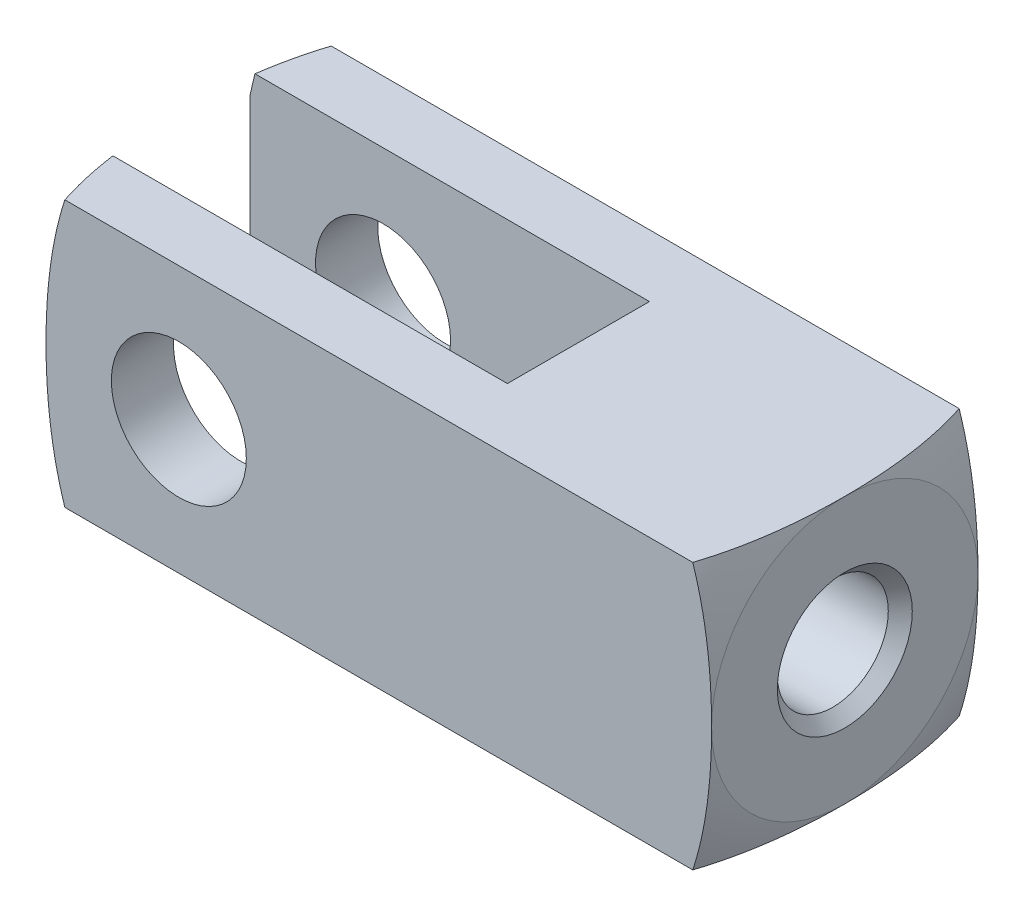
ISO-10303-21;
HEADER;
FILE_DESCRIPTION(('STEP AP214'),'2;1');
FILE_NAME('part.step','',(''),(''),'','','');
FILE_SCHEMA(('AUTOMOTIVE_DESIGN { 1 0 10303 214 1 1 1 1 }'));
ENDSEC;
DATA;
#1=APPLICATION_CONTEXT('core data for automotive mechanical design processes');
#2=APPLICATION_PROTOCOL_DEFINITION('international standard','automotive_design',2000,#1);
#3=PRODUCT_CONTEXT('',#1,'mechanical');
#4=PRODUCT('Part','Part','',(#3));
#5=PRODUCT_RELATED_PRODUCT_CATEGORY('part','',(#4));
#6=PRODUCT_DEFINITION_FORMATION('','',#4);
#7=PRODUCT_DEFINITION_CONTEXT('part definition',#1,'design');
#8=PRODUCT_DEFINITION('design','',#6,#7);
#9=PRODUCT_DEFINITION_SHAPE('','',#8);
#10=(LENGTH_UNIT() NAMED_UNIT(*) SI_UNIT(.MILLI.,.METRE.));
#11=(NAMED_UNIT(*) PLANE_ANGLE_UNIT() SI_UNIT($,.RADIAN.));
#12=(NAMED_UNIT(*) SI_UNIT($,.STERADIAN.) SOLID_ANGLE_UNIT());
#13=UNCERTAINTY_MEASURE_WITH_UNIT(LENGTH_MEASURE(1.E-05),#10,'distance_accuracy_value','');
#14=(GEOMETRIC_REPRESENTATION_CONTEXT(3) GLOBAL_UNCERTAINTY_ASSIGNED_CONTEXT((#13)) GLOBAL_UNIT_ASSIGNED_CONTEXT((#10,
#11,#12)) REPRESENTATION_CONTEXT('',''));
#15=CARTESIAN_POINT('',(0.,0.,0.));
#16=DIRECTION('',(0.,0.,1.));
#17=DIRECTION('',(1.,0.,0.));
#18=AXIS2_PLACEMENT_3D('',#15,#16,#17);
#19=CARTESIAN_POINT('',(19.0499999999361,0.,0.));
#20=DIRECTION('',(1.,0.,0.));
#21=DIRECTION('',(0.,0.,-1.));
#22=AXIS2_PLACEMENT_3D('',#19,#20,#21);
#23=CONICAL_SURFACE('',#22,2.41299999993316,0.785398163397448);
#24=CARTESIAN_POINT('',(18.62074,0.,0.));
#25=DIRECTION('',(-1.,0.,0.));
#26=DIRECTION('',(0.,0.,1.));
#27=AXIS2_PLACEMENT_3D('',#24,#25,#26);
#28=CIRCLE('',#27,1.98374);
#29=CARTESIAN_POINT('',(18.62074,0.,1.98374));
#30=VERTEX_POINT('',#29);
#31=EDGE_CURVE('E114',#30,#30,#28,.T.);
#32=ORIENTED_EDGE('',*,*,#31,.T.);
#33=EDGE_LOOP('',(#32));
#34=FACE_BOUND('',#33,.T.);
#35=CARTESIAN_POINT('',(19.0500000000497,0.,0.));
#36=DIRECTION('',(1.,0.,0.));
#37=DIRECTION('',(0.,0.,-1.));
#38=AXIS2_PLACEMENT_3D('',#35,#36,#37);
#39=CIRCLE('',#38,2.41300000004685);
#40=CARTESIAN_POINT('',(19.0500000000497,0.,-2.41300000004685));
#41=VERTEX_POINT('',#40);
#42=EDGE_CURVE('E640',#41,#41,#39,.T.);
#43=ORIENTED_EDGE('',*,*,#42,.T.);
#44=EDGE_LOOP('',(#43));
#45=FACE_BOUND('',#44,.T.);
#46=ADVANCED_FACE('F17',(#34,#45),#23,.F.);
#47=CARTESIAN_POINT('',(19.05,0.,0.));
#48=DIRECTION('',(-1.,0.,0.));
#49=DIRECTION('',(0.,0.,1.));
#50=AXIS2_PLACEMENT_3D('',#47,#48,#49);
#51=CYLINDRICAL_SURFACE('',#50,1.98374);
#52=CARTESIAN_POINT('',(9.525,0.,0.));
#53=DIRECTION('',(-1.,0.,0.));
#54=DIRECTION('',(0.,0.,1.));
#55=AXIS2_PLACEMENT_3D('',#52,#53,#54);
#56=CIRCLE('',#55,1.98374);
#57=CARTESIAN_POINT('',(9.525,0.,1.98374));
#58=VERTEX_POINT('',#57);
#59=EDGE_CURVE('E338',#58,#58,#56,.F.);
#60=ORIENTED_EDGE('',*,*,#59,.F.);
#61=EDGE_LOOP('',(#60));
#62=FACE_BOUND('',#61,.T.);
#63=ORIENTED_EDGE('',*,*,#31,.F.);
#64=EDGE_LOOP('',(#63));
#65=FACE_BOUND('',#64,.T.);
#66=ADVANCED_FACE('F432',(#62,#65),#51,.F.);
#67=CARTESIAN_POINT('',(0.,0.,-4.7625));
#68=DIRECTION('',(0.,0.,1.));
#69=DIRECTION('',(1.,0.,0.));
#70=AXIS2_PLACEMENT_3D('',#67,#68,#69);
#71=CYLINDRICAL_SURFACE('',#70,2.413);
#72=CARTESIAN_POINT('',(0.,0.,-2.54));
#73=DIRECTION('',(0.,0.,1.));
#74=DIRECTION('',(1.,0.,0.));
#75=AXIS2_PLACEMENT_3D('',#72,#73,#74);
#76=CIRCLE('',#75,2.413);
#77=CARTESIAN_POINT('',(2.413,0.,-2.54));
#78=VERTEX_POINT('',#77);
#79=EDGE_CURVE('E345',#78,#78,#76,.F.);
#80=ORIENTED_EDGE('',*,*,#79,.F.);
#81=EDGE_LOOP('',(#80));
#82=FACE_BOUND('',#81,.T.);
#83=CARTESIAN_POINT('',(0.,0.,-4.7625));
#84=DIRECTION('',(0.,0.,1.));
#85=DIRECTION('',(1.,0.,0.));
#86=AXIS2_PLACEMENT_3D('',#83,#84,#85);
#87=CIRCLE('',#86,2.413);
#88=CARTESIAN_POINT('',(2.413,0.,-4.7625));
#89=VERTEX_POINT('',#88);
#90=EDGE_CURVE('E642',#89,#89,#87,.F.);
#91=ORIENTED_EDGE('',*,*,#90,.T.);
#92=EDGE_LOOP('',(#91));
#93=FACE_BOUND('',#92,.T.);
#94=ADVANCED_FACE('F436',(#82,#93),#71,.F.);
#95=CARTESIAN_POINT('',(-4.7498,4.7625,4.7625));
#96=DIRECTION('',(1.,0.,0.));
#97=DIRECTION('',(0.,0.,-1.));
#98=AXIS2_PLACEMENT_3D('',#95,#96,#97);
#99=PLANE('',#98);
#100=CARTESIAN_POINT('',(-4.74979999999999,0.,0.));
#101=DIRECTION('',(1.,0.,0.));
#102=DIRECTION('',(0.,0.,-1.));
#103=AXIS2_PLACEMENT_3D('',#100,#101,#102);
#104=CIRCLE('',#103,4.7625);
#105=CARTESIAN_POINT('',(-4.74979999999999,-4.02862336909272,-2.54));
#106=VERTEX_POINT('',#105);
#107=CARTESIAN_POINT('',(-4.74979999999999,0.,-4.7625));
#108=VERTEX_POINT('',#107);
#109=EDGE_CURVE('E22',#106,#108,#104,.T.);
#110=ORIENTED_EDGE('',*,*,#109,.F.);
#111=DIRECTION('',(0.,1.,0.));
#112=VECTOR('',#111,1.);
#113=CARTESIAN_POINT('',(-4.7498,4.7625,-2.54));
#114=LINE('',#113,#112);
#115=CARTESIAN_POINT('',(-4.7498,4.02862336909274,-2.54));
#116=VERTEX_POINT('',#115);
#117=EDGE_CURVE('E131',#116,#106,#114,.F.);
#118=ORIENTED_EDGE('',*,*,#117,.F.);
#119=CARTESIAN_POINT('',(-4.74979999999999,0.,0.));
#120=DIRECTION('',(1.,0.,0.));
#121=DIRECTION('',(0.,0.,-1.));
#122=AXIS2_PLACEMENT_3D('',#119,#120,#121);
#123=CIRCLE('',#122,4.76250000000007);
#124=EDGE_CURVE('E129',#108,#116,#123,.T.);
#125=ORIENTED_EDGE('',*,*,#124,.F.);
#126=EDGE_LOOP('',(#110,#118,#125));
#127=FACE_BOUND('',#126,.T.);
#128=ADVANCED_FACE('F130',(#127),#99,.F.);
#129=CARTESIAN_POINT('',(-4.7498,4.7625,4.7625));
#130=DIRECTION('',(1.,0.,0.));
#131=DIRECTION('',(0.,0.,-1.));
#132=AXIS2_PLACEMENT_3D('',#129,#130,#131);
#133=PLANE('',#132);
#134=DIRECTION('',(0.,1.,0.));
#135=VECTOR('',#134,1.);
#136=CARTESIAN_POINT('',(-4.7498,4.7625,2.54));
#137=LINE('',#136,#135);
#138=CARTESIAN_POINT('',(-4.7498,-4.02862336909273,2.54));
#139=VERTEX_POINT('',#138);
#140=CARTESIAN_POINT('',(-4.7498,4.02862336909272,2.54));
#141=VERTEX_POINT('',#140);
#142=EDGE_CURVE('E335',#139,#141,#137,.T.);
#143=ORIENTED_EDGE('',*,*,#142,.F.);
#144=CARTESIAN_POINT('',(-4.74979999999999,0.,0.));
#145=DIRECTION('',(1.,0.,0.));
#146=DIRECTION('',(0.,0.,-1.));
#147=AXIS2_PLACEMENT_3D('',#144,#145,#146);
#148=CIRCLE('',#147,4.76250000000001);
#149=CARTESIAN_POINT('',(-4.74979999999999,0.,4.7625));
#150=VERTEX_POINT('',#149);
#151=EDGE_CURVE('E216',#150,#139,#148,.T.);
#152=ORIENTED_EDGE('',*,*,#151,.F.);
#153=CARTESIAN_POINT('',(-4.74979999999999,0.,0.));
#154=DIRECTION('',(1.,0.,0.));
#155=DIRECTION('',(0.,0.,-1.));
#156=AXIS2_PLACEMENT_3D('',#153,#154,#155);
#157=CIRCLE('',#156,4.76250000000001);
#158=EDGE_CURVE('E387',#141,#150,#157,.T.);
#159=ORIENTED_EDGE('',*,*,#158,.F.);
#160=EDGE_LOOP('',(#143,#152,#159));
#161=FACE_BOUND('',#160,.T.);
#162=ADVANCED_FACE('F394',(#161),#133,.F.);
#163=CARTESIAN_POINT('',(8.85031250000066,0.,0.));
#164=DIRECTION('',(1.,0.,0.));
#165=DIRECTION('',(0.,1.,0.));
#166=AXIS2_PLACEMENT_3D('',#163,#164,#165);
#167=DEGENERATE_TOROIDAL_SURFACE('',#166,2.38125000000023,10.4739666153822,.T.);
#168=CARTESIAN_POINT('',(18.3764431378876,-4.7625,-4.7625));
#169=CARTESIAN_POINT('',(18.4386092465968,-4.57020591973854,-4.7625));
#170=CARTESIAN_POINT('',(18.4958412351753,-4.37634827376735,-4.7625));
#171=CARTESIAN_POINT('',(18.6008458182985,-3.98616603870625,-4.7625));
#172=CARTESIAN_POINT('',(18.6486221761621,-3.78984246426873,-4.7625));
#173=CARTESIAN_POINT('',(18.7349156632904,-3.39640861936142,-4.7625));
#174=CARTESIAN_POINT('',(18.7734862113071,-3.1993099864556,-4.7625));
#175=CARTESIAN_POINT('',(18.8422995343142,-2.80365476149187,-4.7625));
#176=CARTESIAN_POINT('',(18.8725415641126,-2.60509804060271,-4.7625));
#177=CARTESIAN_POINT('',(18.9252792540766,-2.20733625877605,-4.7625));
#178=CARTESIAN_POINT('',(18.9477889367224,-2.00813303987482,-4.7625));
#179=CARTESIAN_POINT('',(18.9857846938484,-1.60905874570638,-4.7625));
#180=CARTESIAN_POINT('',(19.0012705352312,-1.40918764849628,-4.7625));
#181=CARTESIAN_POINT('',(19.0258873513128,-1.00783387768998,-4.7625));
#182=CARTESIAN_POINT('',(19.0349788792243,-0.806348824110806,-4.7625));
#183=CARTESIAN_POINT('',(19.0470107345775,-0.40323884819552,-4.7625));
#184=CARTESIAN_POINT('',(19.0499524512676,-0.201613967743576,-4.7625));
#185=CARTESIAN_POINT('',(19.05,0.,-4.7625));
#186=B_SPLINE_CURVE_WITH_KNOTS('',3,(#168,#169,#170,#171,#172,#173,#174,#175,#176,#177,#178,
#179,#180,#181,#182,#183,#184,#185),.UNSPECIFIED.,.F.,.F.,(4,2,2,2,2,2,2,2,4),(0.,
0.606169794654094,1.2120978478512,1.81441939195448,2.41679481112276,3.0180719932136,
3.61936912818095,4.22434390369564,4.82918200003975),.UNSPECIFIED.);
#187=CARTESIAN_POINT('',(18.3764431378876,-4.7625,-4.7625));
#188=VERTEX_POINT('',#187);
#189=CARTESIAN_POINT('',(19.05,0.,-4.7625));
#190=VERTEX_POINT('',#189);
#191=EDGE_CURVE('E126',#188,#190,#186,.T.);
#192=ORIENTED_EDGE('',*,*,#191,.T.);
#193=CARTESIAN_POINT('',(19.05,0.,0.));
#194=DIRECTION('',(1.,0.,0.));
#195=DIRECTION('',(0.,1.,0.));
#196=AXIS2_PLACEMENT_3D('',#193,#194,#195);
#197=CIRCLE('',#196,4.76250000000001);
#198=CARTESIAN_POINT('',(19.05,-4.7625,0.));
#199=VERTEX_POINT('',#198);
#200=EDGE_CURVE('E113',#190,#199,#197,.F.);
#201=ORIENTED_EDGE('',*,*,#200,.T.);
#202=CARTESIAN_POINT('',(19.05,-4.7625,0.));
#203=CARTESIAN_POINT('',(19.0499524512676,-4.7625,-0.201613967743576));
#204=CARTESIAN_POINT('',(19.0470107345775,-4.7625,-0.40323884819552));
#205=CARTESIAN_POINT('',(19.0349788792243,-4.7625,-0.806348824110805));
#206=CARTESIAN_POINT('',(19.0258873513128,-4.7625,-1.00783387768998));
#207=CARTESIAN_POINT('',(19.0012705352312,-4.7625,-1.40918764849628));
#208=CARTESIAN_POINT('',(18.9857846938484,-4.7625,-1.60905874570638));
#209=CARTESIAN_POINT('',(18.9477889367224,-4.7625,-2.00813303987482));
#210=CARTESIAN_POINT('',(18.9252792540766,-4.7625,-2.20733625877605));
#211=CARTESIAN_POINT('',(18.8725415641126,-4.7625,-2.60509804060271));
#212=CARTESIAN_POINT('',(18.8422995343142,-4.7625,-2.80365476149187));
#213=CARTESIAN_POINT('',(18.7734862113071,-4.7625,-3.1993099864556));
#214=CARTESIAN_POINT('',(18.7349156632904,-4.7625,-3.39640861936143));
#215=CARTESIAN_POINT('',(18.6486221761621,-4.7625,-3.78984246426873));
#216=CARTESIAN_POINT('',(18.6008458182985,-4.7625,-3.98616603870625));
#217=CARTESIAN_POINT('',(18.4958412351753,-4.7625,-4.37634827376735));
#218=CARTESIAN_POINT('',(18.4386092465968,-4.7625,-4.57020591973854));
#219=CARTESIAN_POINT('',(18.3764431378876,-4.7625,-4.7625));
#220=B_SPLINE_CURVE_WITH_KNOTS('',3,(#202,#203,#204,#205,#206,#207,#208,#209,#210,#211,#212,
#213,#214,#215,#216,#217,#218,#219),.UNSPECIFIED.,.F.,.F.,(4,2,2,2,2,2,2,2,4),(0.,
0.604838096344111,1.2098128718588,1.81111000682615,2.41238718891699,3.01476260808527,
3.61708415218855,4.22301220538566,4.82918200003975),.UNSPECIFIED.);
#221=EDGE_CURVE('E215',#199,#188,#220,.T.);
#222=ORIENTED_EDGE('',*,*,#221,.T.);
#223=EDGE_LOOP('',(#192,#201,#222));
#224=FACE_BOUND('',#223,.T.);
#225=ADVANCED_FACE('F423',(#224),#167,.T.);
#226=CARTESIAN_POINT('',(5.44988749999944,0.,0.));
#227=DIRECTION('',(1.,0.,0.));
#228=DIRECTION('',(0.,0.,-1.));
#229=AXIS2_PLACEMENT_3D('',#226,#227,#228);
#230=DEGENERATE_TOROIDAL_SURFACE('',#229,2.38125000000032,10.4739666153823,.T.);
#231=CARTESIAN_POINT('',(-4.07624313788609,-4.76249999999701,-4.76249999999744));
#232=CARTESIAN_POINT('',(-4.13479589185059,-4.76249999999892,-4.58137166019574));
#233=CARTESIAN_POINT('',(-4.18897646512336,-4.76249999999971,-4.39885314785462));
#234=CARTESIAN_POINT('',(-4.28884940483545,-4.76250000000029,-4.03186849401229));
#235=CARTESIAN_POINT('',(-4.33455733395949,-4.76250000000008,-3.8474065945218));
#236=CARTESIAN_POINT('',(-4.41794797670984,-4.76249999999992,-3.47672688864885));
#237=CARTESIAN_POINT('',(-4.45563219539087,-4.76249999999996,-3.29050941842465));
#238=CARTESIAN_POINT('',(-4.52352684711196,-4.76250000000004,-2.91635560038737));
#239=CARTESIAN_POINT('',(-4.55372325660627,-4.76250000000008,-2.72841670078748));
#240=CARTESIAN_POINT('',(-4.58037733188037,-4.7625,-2.54000000000001));
#241=B_SPLINE_CURVE_WITH_KNOTS('',3,(#231,#232,#233,#234,#235,#236,#237,#238,#239,#240),
.UNSPECIFIED.,.F.,.F.,(4,2,2,2,4),(0.,0.570985385839729,1.14091135279321,1.71073032100635,
2.28160854871054),.UNSPECIFIED.);
#242=CARTESIAN_POINT('',(-4.07624313789227,-4.76249999999545,-4.7625));
#243=VERTEX_POINT('',#242);
#244=CARTESIAN_POINT('',(-4.58037733188037,-4.7625,-2.54));
#245=VERTEX_POINT('',#244);
#246=EDGE_CURVE('E251',#243,#245,#241,.T.);
#247=ORIENTED_EDGE('',*,*,#246,.T.);
#248=CARTESIAN_POINT('',(-4.74979999999999,-4.02862336909272,-2.54));
#249=CARTESIAN_POINT('',(-4.73763651286028,-4.09021768561914,-2.54));
#250=CARTESIAN_POINT('',(-4.72499041684053,-4.15171656210413,-2.54));
#251=CARTESIAN_POINT('',(-4.69872630892538,-4.27448971653947,-2.54));
#252=CARTESIAN_POINT('',(-4.68510854985641,-4.33576404858505,-2.54));
#253=CARTESIAN_POINT('',(-4.64277502255171,-4.51926000535524,-2.54));
#254=CARTESIAN_POINT('',(-4.61258148584373,-4.64114199607287,-2.54));
#255=CARTESIAN_POINT('',(-4.58037733188037,-4.76250000000001,-2.54));
#256=B_SPLINE_CURVE_WITH_KNOTS('',3,(#248,#249,#250,#251,#252,#253,#254,#255),.UNSPECIFIED.,.F.,
.F.,(4,2,2,4),(0.,0.188349194508567,0.376649558086833,0.753288776160169),.UNSPECIFIED.);
#257=EDGE_CURVE('E111',#106,#245,#256,.T.);
#258=ORIENTED_EDGE('',*,*,#257,.F.);
#259=ORIENTED_EDGE('',*,*,#109,.T.);
#260=CARTESIAN_POINT('',(-4.74979999999999,0.,-4.7625));
#261=CARTESIAN_POINT('',(-4.74975245126756,-0.201613967743176,-4.7625));
#262=CARTESIAN_POINT('',(-4.74681073457755,-0.403238848194718,-4.7625));
#263=CARTESIAN_POINT('',(-4.73477887922439,-0.806348824109202,-4.7625));
#264=CARTESIAN_POINT('',(-4.72568735131285,-1.00783387768798,-4.7625));
#265=CARTESIAN_POINT('',(-4.70107053523143,-1.40918764849348,-4.7625));
#266=CARTESIAN_POINT('',(-4.68558469384864,-1.6090587457032,-4.7625));
#267=CARTESIAN_POINT('',(-4.64758893672285,-2.00813303987087,-4.7625));
#268=CARTESIAN_POINT('',(-4.62507925407716,-2.20733625877171,-4.7625));
#269=CARTESIAN_POINT('',(-4.57234156411331,-2.60509804059761,-4.7625));
#270=CARTESIAN_POINT('',(-4.54209953431506,-2.80365476148639,-4.7625));
#271=CARTESIAN_POINT('',(-4.47328621130827,-3.19930998644936,-4.7625));
#272=CARTESIAN_POINT('',(-4.4347156632917,-3.39640861935482,-4.7625));
#273=CARTESIAN_POINT('',(-4.34842217616381,-3.78984246426138,-4.7625));
#274=CARTESIAN_POINT('',(-4.30064581830049,-3.98616603869854,-4.7625));
#275=CARTESIAN_POINT('',(-4.19564123517769,-4.37634827375893,-4.7625));
#276=CARTESIAN_POINT('',(-4.13840924659949,-4.57020591972977,-4.7625));
#277=CARTESIAN_POINT('',(-4.07624313789052,-4.7624999999909,-4.7625));
#278=B_SPLINE_CURVE_WITH_KNOTS('',3,(#260,#261,#262,#263,#264,#265,#266,#267,#268,#269,#270,
#271,#272,#273,#274,#275,#276,#277),.UNSPECIFIED.,.F.,.F.,(4,2,2,2,2,2,2,2,4),(0.,
0.604838096342908,1.20981287185639,1.81111000682256,2.41238718891223,3.01476260807932,
3.61708415218141,4.2230122053773,4.82918200003018),.UNSPECIFIED.);
#279=EDGE_CURVE('E108',#108,#243,#278,.T.);
#280=ORIENTED_EDGE('',*,*,#279,.T.);
#281=EDGE_LOOP('',(#247,#258,#259,#280));
#282=FACE_BOUND('',#281,.T.);
#283=ADVANCED_FACE('F107',(#282),#230,.T.);
#284=CARTESIAN_POINT('',(19.05,-4.7625,4.7625));
#285=DIRECTION('',(-1.,0.,0.));
#286=DIRECTION('',(0.,0.,1.));
#287=AXIS2_PLACEMENT_3D('',#284,#285,#286);
#288=PLANE('',#287);
#289=ORIENTED_EDGE('',*,*,#42,.F.);
#290=EDGE_LOOP('',(#289));
#291=FACE_BOUND('',#290,.T.);
#292=CARTESIAN_POINT('',(19.05,0.,0.));
#293=DIRECTION('',(1.,0.,0.));
#294=DIRECTION('',(0.,1.,0.));
#295=AXIS2_PLACEMENT_3D('',#292,#293,#294);
#296=CIRCLE('',#295,4.76250000000001);
#297=CARTESIAN_POINT('',(19.05,0.,4.7625));
#298=VERTEX_POINT('',#297);
#299=CARTESIAN_POINT('',(19.05,4.7625,0.));
#300=VERTEX_POINT('',#299);
#301=EDGE_CURVE('E286',#298,#300,#296,.F.);
#302=ORIENTED_EDGE('',*,*,#301,.F.);
#303=CARTESIAN_POINT('',(19.05,0.,0.));
#304=DIRECTION('',(1.,0.,0.));
#305=DIRECTION('',(0.,1.,0.));
#306=AXIS2_PLACEMENT_3D('',#303,#304,#305);
#307=CIRCLE('',#306,4.76250000000001);
#308=EDGE_CURVE('E287',#199,#298,#307,.F.);
#309=ORIENTED_EDGE('',*,*,#308,.F.);
#310=ORIENTED_EDGE('',*,*,#200,.F.);
#311=CARTESIAN_POINT('',(19.05,0.,0.));
#312=DIRECTION('',(1.,0.,0.));
#313=DIRECTION('',(0.,1.,0.));
#314=AXIS2_PLACEMENT_3D('',#311,#312,#313);
#315=CIRCLE('',#314,4.7625);
#316=EDGE_CURVE('E125',#300,#190,#315,.F.);
#317=ORIENTED_EDGE('',*,*,#316,.F.);
#318=EDGE_LOOP('',(#302,#309,#310,#317));
#319=FACE_BOUND('',#318,.T.);
#320=ADVANCED_FACE('F305',(#291,#319),#288,.F.);
#321=CARTESIAN_POINT('',(0.,0.,-4.7625));
#322=DIRECTION('',(0.,0.,1.));
#323=DIRECTION('',(1.,0.,0.));
#324=AXIS2_PLACEMENT_3D('',#321,#322,#323);
#325=PLANE('',#324);
#326=CARTESIAN_POINT('',(-4.07624313788427,4.76249999999685,-4.76249999999443));
#327=CARTESIAN_POINT('',(-4.13840924659601,4.57020591973615,-4.762499999998));
#328=CARTESIAN_POINT('',(-4.19564123517546,4.37634827376527,-4.76249999999946));
#329=CARTESIAN_POINT('',(-4.30064581829941,3.98616603870445,-4.76250000000053));
#330=CARTESIAN_POINT('',(-4.34842217616263,3.78984246426689,-4.76250000000014));
#331=CARTESIAN_POINT('',(-4.43471566329062,3.39640861935966,-4.76249999999986));
#332=CARTESIAN_POINT('',(-4.47328621130739,3.19930998645393,-4.76249999999996));
#333=CARTESIAN_POINT('',(-4.54209953431446,2.80365476149038,-4.76250000000004));
#334=CARTESIAN_POINT('',(-4.57234156411279,2.60509804060129,-4.76250000000001));
#335=CARTESIAN_POINT('',(-4.62507925407679,2.20733625877482,-4.76249999999999));
#336=CARTESIAN_POINT('',(-4.64758893672255,2.00813303987371,-4.7625));
#337=CARTESIAN_POINT('',(-4.68558469384845,1.60905874570551,-4.7625));
#338=CARTESIAN_POINT('',(-4.70107053523129,1.40918764849554,-4.7625));
#339=CARTESIAN_POINT('',(-4.72568735131278,1.00783387768948,-4.7625));
#340=CARTESIAN_POINT('',(-4.73477887922435,0.806348824110408,-4.7625));
#341=CARTESIAN_POINT('',(-4.74681073457754,0.403238848195326,-4.7625));
#342=CARTESIAN_POINT('',(-4.74975245126757,0.201613967743479,-4.7625));
#343=CARTESIAN_POINT('',(-4.74979999999999,0.,-4.7625));
#344=B_SPLINE_CURVE_WITH_KNOTS('',3,(#326,#327,#328,#329,#330,#331,#332,#333,#334,#335,#336,
#337,#338,#339,#340,#341,#342,#343),.UNSPECIFIED.,.F.,.F.,(4,2,2,2,2,2,2,2,4),(0.,
0.606169794654035,1.21209784785098,1.814419391954,2.41679481112204,3.01807199321251,
3.61936912817948,4.22434390369384,4.82918200003767),.UNSPECIFIED.);
#345=CARTESIAN_POINT('',(-4.07624313788993,4.76249999999906,-4.76249999999364));
#346=VERTEX_POINT('',#345);
#347=EDGE_CURVE('E119',#346,#108,#344,.T.);
#348=ORIENTED_EDGE('',*,*,#347,.F.);
#349=DIRECTION('',(1.,0.,0.));
#350=VECTOR('',#349,1.);
#351=CARTESIAN_POINT('',(19.05,4.7625,-4.76249999998006));
#352=LINE('',#351,#350);
#353=CARTESIAN_POINT('',(18.3764431378923,4.76249999999544,-4.7625));
#354=VERTEX_POINT('',#353);
#355=EDGE_CURVE('E285',#346,#354,#352,.T.);
#356=ORIENTED_EDGE('',*,*,#355,.T.);
#357=CARTESIAN_POINT('',(19.05,0.,-4.7625));
#358=CARTESIAN_POINT('',(19.0499524512676,0.201613967743175,-4.7625));
#359=CARTESIAN_POINT('',(19.0470107345776,0.403238848194717,-4.7625));
#360=CARTESIAN_POINT('',(19.0349788792244,0.806348824109201,-4.7625));
#361=CARTESIAN_POINT('',(19.0258873513129,1.00783387768798,-4.7625));
#362=CARTESIAN_POINT('',(19.0012705352314,1.40918764849348,-4.7625));
#363=CARTESIAN_POINT('',(18.9857846938486,1.6090587457032,-4.7625));
#364=CARTESIAN_POINT('',(18.9477889367229,2.00813303987087,-4.7625));
#365=CARTESIAN_POINT('',(18.9252792540772,2.20733625877171,-4.7625));
#366=CARTESIAN_POINT('',(18.8725415641133,2.60509804059761,-4.7625));
#367=CARTESIAN_POINT('',(18.8422995343151,2.80365476148638,-4.7625));
#368=CARTESIAN_POINT('',(18.7734862113083,3.19930998644935,-4.7625));
#369=CARTESIAN_POINT('',(18.7349156632917,3.39640861935481,-4.7625));
#370=CARTESIAN_POINT('',(18.6486221761638,3.78984246426138,-4.7625));
#371=CARTESIAN_POINT('',(18.6008458183005,3.98616603869853,-4.7625));
#372=CARTESIAN_POINT('',(18.4958412351777,4.37634827375892,-4.7625));
#373=CARTESIAN_POINT('',(18.4386092465995,4.57020591972977,-4.7625));
#374=CARTESIAN_POINT('',(18.3764431378905,4.76249999999089,-4.7625));
#375=B_SPLINE_CURVE_WITH_KNOTS('',3,(#357,#358,#359,#360,#361,#362,#363,#364,#365,#366,#367,
#368,#369,#370,#371,#372,#373,#374),.UNSPECIFIED.,.F.,.F.,(4,2,2,2,2,2,2,2,4),(0.,
0.604838096342908,1.20981287185639,1.81111000682256,2.41238718891223,3.01476260807932,
3.61708415218141,4.2230122053773,4.82918200003018),.UNSPECIFIED.);
#376=EDGE_CURVE('E339',#190,#354,#375,.T.);
#377=ORIENTED_EDGE('',*,*,#376,.F.);
#378=ORIENTED_EDGE('',*,*,#191,.F.);
#379=DIRECTION('',(1.,0.,0.));
#380=VECTOR('',#379,1.);
#381=CARTESIAN_POINT('',(-4.7498,-4.7625,-4.7625));
#382=LINE('',#381,#380);
#383=EDGE_CURVE('E123',#188,#243,#382,.F.);
#384=ORIENTED_EDGE('',*,*,#383,.T.);
#385=ORIENTED_EDGE('',*,*,#279,.F.);
#386=EDGE_LOOP('',(#348,#356,#377,#378,#384,#385));
#387=FACE_BOUND('',#386,.T.);
#388=ORIENTED_EDGE('',*,*,#90,.F.);
#389=EDGE_LOOP('',(#388));
#390=FACE_BOUND('',#389,.T.);
#391=ADVANCED_FACE('F116',(#387,#390),#325,.F.);
#392=CARTESIAN_POINT('',(8.85031249999949,0.,0.));
#393=DIRECTION('',(1.,0.,0.));
#394=DIRECTION('',(0.,1.,0.));
#395=AXIS2_PLACEMENT_3D('',#392,#393,#394);
#396=DEGENERATE_TOROIDAL_SURFACE('',#395,2.38124999999974,10.4739666153835,.T.);
#397=ORIENTED_EDGE('',*,*,#316,.T.);
#398=ORIENTED_EDGE('',*,*,#376,.T.);
#399=CARTESIAN_POINT('',(18.3764431378861,4.76249999999702,-4.76249999999743));
#400=CARTESIAN_POINT('',(18.4386092465966,4.76249999999893,-4.57020591973641));
#401=CARTESIAN_POINT('',(18.4958412351756,4.76249999999971,-4.37634827376542));
#402=CARTESIAN_POINT('',(18.6008458182992,4.76250000000029,-3.98616603870454));
#403=CARTESIAN_POINT('',(18.6486221761625,4.76250000000008,-3.78984246426703));
#404=CARTESIAN_POINT('',(18.7349156632906,4.76249999999992,-3.39640861935984));
#405=CARTESIAN_POINT('',(18.7734862113074,4.76249999999998,-3.1993099864541));
#406=CARTESIAN_POINT('',(18.8422995343144,4.76250000000002,-2.80365476149054));
#407=CARTESIAN_POINT('',(18.8725415641128,4.7625,-2.60509804060146));
#408=CARTESIAN_POINT('',(18.9252792540768,4.76249999999999,-2.20733625877498));
#409=CARTESIAN_POINT('',(18.9477889367225,4.7625,-2.00813303987385));
#410=CARTESIAN_POINT('',(18.9857846938484,4.7625,-1.60905874570561));
#411=CARTESIAN_POINT('',(19.0012705352313,4.7625,-1.40918764849561));
#412=CARTESIAN_POINT('',(19.0258873513128,4.7625,-1.00783387768952));
#413=CARTESIAN_POINT('',(19.0349788792244,4.7625,-0.806348824110441));
#414=CARTESIAN_POINT('',(19.0470107345776,4.7625,-0.403238848195341));
#415=CARTESIAN_POINT('',(19.0499524512676,4.7625,-0.201613967743488));
#416=CARTESIAN_POINT('',(19.05,4.7625,0.));
#417=B_SPLINE_CURVE_WITH_KNOTS('',3,(#399,#400,#401,#402,#403,#404,#405,#406,#407,#408,#409,
#410,#411,#412,#413,#414,#415,#416),.UNSPECIFIED.,.F.,.F.,(4,2,2,2,2,2,2,2,4),(0.,
0.606169794653945,1.21209784785085,1.81441939195387,2.41679481112191,3.01807199321244,
3.61936912817947,4.22434390369387,4.82918200003771),.UNSPECIFIED.);
#418=EDGE_CURVE('E279',#354,#300,#417,.T.);
#419=ORIENTED_EDGE('',*,*,#418,.T.);
#420=EDGE_LOOP('',(#397,#398,#419));
#421=FACE_BOUND('',#420,.T.);
#422=ADVANCED_FACE('F167',(#421),#396,.T.);
#423=CARTESIAN_POINT('',(-4.7498,4.7625,2.54));
#424=DIRECTION('',(0.,0.,-1.));
#425=DIRECTION('',(-1.,0.,0.));
#426=AXIS2_PLACEMENT_3D('',#423,#424,#425);
#427=PLANE('',#426);
#428=DIRECTION('',(1.,0.,0.));
#429=VECTOR('',#428,1.);
#430=CARTESIAN_POINT('',(-4.7498,-4.7625,2.54));
#431=LINE('',#430,#429);
#432=CARTESIAN_POINT('',(9.525,-4.7625,2.54));
#433=VERTEX_POINT('',#432);
#434=CARTESIAN_POINT('',(-4.58037733188038,-4.7625,2.54));
#435=VERTEX_POINT('',#434);
#436=EDGE_CURVE('E246',#433,#435,#431,.F.);
#437=ORIENTED_EDGE('',*,*,#436,.T.);
#438=CARTESIAN_POINT('',(-4.74979999999999,-4.02862336909272,2.54));
#439=CARTESIAN_POINT('',(-4.73763651286029,-4.09021768561914,2.54));
#440=CARTESIAN_POINT('',(-4.72499041684053,-4.15171656210413,2.54));
#441=CARTESIAN_POINT('',(-4.69872630892538,-4.27448971653947,2.54));
#442=CARTESIAN_POINT('',(-4.68510854985641,-4.33576404858505,2.54));
#443=CARTESIAN_POINT('',(-4.64277502255171,-4.51926000535524,2.54));
#444=CARTESIAN_POINT('',(-4.61258148584373,-4.64114199607287,2.54));
#445=CARTESIAN_POINT('',(-4.58037733188037,-4.76250000000001,2.54));
#446=B_SPLINE_CURVE_WITH_KNOTS('',3,(#438,#439,#440,#441,#442,#443,#444,#445),.UNSPECIFIED.,.F.,
.F.,(4,2,2,4),(0.,0.188349194508567,0.376649558086833,0.753288776160169),.UNSPECIFIED.);
#447=EDGE_CURVE('E209',#139,#435,#446,.T.);
#448=ORIENTED_EDGE('',*,*,#447,.F.);
#449=ORIENTED_EDGE('',*,*,#142,.T.);
#450=CARTESIAN_POINT('',(-4.58037733188037,4.76250000000001,2.54));
#451=CARTESIAN_POINT('',(-4.61258148584373,4.64114199607287,2.54));
#452=CARTESIAN_POINT('',(-4.64277502255171,4.51926000535524,2.54));
#453=CARTESIAN_POINT('',(-4.68510854985641,4.33576404858505,2.54));
#454=CARTESIAN_POINT('',(-4.69872630892538,4.27448971653947,2.54));
#455=CARTESIAN_POINT('',(-4.72499041684053,4.15171656210413,2.54));
#456=CARTESIAN_POINT('',(-4.73763651286029,4.09021768561914,2.54));
#457=CARTESIAN_POINT('',(-4.7498,4.02862336909272,2.54));
#458=B_SPLINE_CURVE_WITH_KNOTS('',3,(#450,#451,#452,#453,#454,#455,#456,#457),.UNSPECIFIED.,.F.,
.F.,(4,2,2,4),(0.,0.376639218073335,0.564939581651602,0.753288776160167),.UNSPECIFIED.);
#459=CARTESIAN_POINT('',(-4.58037733188037,4.7625,2.54));
#460=VERTEX_POINT('',#459);
#461=EDGE_CURVE('E203',#460,#141,#458,.T.);
#462=ORIENTED_EDGE('',*,*,#461,.F.);
#463=DIRECTION('',(1.,0.,0.));
#464=VECTOR('',#463,1.);
#465=CARTESIAN_POINT('',(19.05,4.7625,2.54));
#466=LINE('',#465,#464);
#467=CARTESIAN_POINT('',(9.525,4.7625,2.54));
#468=VERTEX_POINT('',#467);
#469=EDGE_CURVE('E352',#460,#468,#466,.T.);
#470=ORIENTED_EDGE('',*,*,#469,.T.);
#471=DIRECTION('',(0.,1.,0.));
#472=VECTOR('',#471,1.);
#473=CARTESIAN_POINT('',(9.525,4.7625,2.54));
#474=LINE('',#473,#472);
#475=EDGE_CURVE('E342',#433,#468,#474,.T.);
#476=ORIENTED_EDGE('',*,*,#475,.F.);
#477=EDGE_LOOP('',(#437,#448,#449,#462,#470,#476));
#478=FACE_BOUND('',#477,.T.);
#479=CARTESIAN_POINT('',(0.,0.,2.54));
#480=DIRECTION('',(0.,0.,1.));
#481=DIRECTION('',(1.,0.,0.));
#482=AXIS2_PLACEMENT_3D('',#479,#480,#481);
#483=CIRCLE('',#482,2.413);
#484=CARTESIAN_POINT('',(2.413,0.,2.54));
#485=VERTEX_POINT('',#484);
#486=EDGE_CURVE('E185',#485,#485,#483,.T.);
#487=ORIENTED_EDGE('',*,*,#486,.T.);
#488=EDGE_LOOP('',(#487));
#489=FACE_BOUND('',#488,.T.);
#490=ADVANCED_FACE('F196',(#478,#489),#427,.T.);
#491=CARTESIAN_POINT('',(9.525,4.7625,2.54));
#492=DIRECTION('',(-1.,0.,0.));
#493=DIRECTION('',(0.,0.,1.));
#494=AXIS2_PLACEMENT_3D('',#491,#492,#493);
#495=PLANE('',#494);
#496=DIRECTION('',(0.,0.,-1.));
#497=VECTOR('',#496,1.);
#498=CARTESIAN_POINT('',(9.525,4.7625,4.7625));
#499=LINE('',#498,#497);
#500=CARTESIAN_POINT('',(9.525,4.7625,-2.54));
#501=VERTEX_POINT('',#500);
#502=EDGE_CURVE('E348',#468,#501,#499,.T.);
#503=ORIENTED_EDGE('',*,*,#502,.T.);
#504=DIRECTION('',(0.,1.,0.));
#505=VECTOR('',#504,1.);
#506=CARTESIAN_POINT('',(9.525,4.7625,-2.54));
#507=LINE('',#506,#505);
#508=CARTESIAN_POINT('',(9.525,-4.7625,-2.54));
#509=VERTEX_POINT('',#508);
#510=EDGE_CURVE('E141',#509,#501,#507,.T.);
#511=ORIENTED_EDGE('',*,*,#510,.F.);
#512=DIRECTION('',(0.,0.,1.));
#513=VECTOR('',#512,1.);
#514=CARTESIAN_POINT('',(9.525,-4.7625,4.7625));
#515=LINE('',#514,#513);
#516=EDGE_CURVE('E331',#509,#433,#515,.T.);
#517=ORIENTED_EDGE('',*,*,#516,.T.);
#518=ORIENTED_EDGE('',*,*,#475,.T.);
#519=EDGE_LOOP('',(#503,#511,#517,#518));
#520=FACE_BOUND('',#519,.T.);
#521=ORIENTED_EDGE('',*,*,#59,.T.);
#522=EDGE_LOOP('',(#521));
#523=FACE_BOUND('',#522,.T.);
#524=ADVANCED_FACE('F191',(#520,#523),#495,.T.);
#525=CARTESIAN_POINT('',(9.525,4.7625,-2.54));
#526=DIRECTION('',(0.,0.,1.));
#527=DIRECTION('',(1.,0.,0.));
#528=AXIS2_PLACEMENT_3D('',#525,#526,#527);
#529=PLANE('',#528);
#530=DIRECTION('',(1.,0.,0.));
#531=VECTOR('',#530,1.);
#532=CARTESIAN_POINT('',(19.05,4.7625,-2.54));
#533=LINE('',#532,#531);
#534=CARTESIAN_POINT('',(-4.58037733188038,4.7625,-2.54));
#535=VERTEX_POINT('',#534);
#536=EDGE_CURVE('E351',#501,#535,#533,.F.);
#537=ORIENTED_EDGE('',*,*,#536,.T.);
#538=CARTESIAN_POINT('',(-4.7498,4.02862336909272,-2.54));
#539=CARTESIAN_POINT('',(-4.73763651286029,4.09021768561914,-2.54));
#540=CARTESIAN_POINT('',(-4.72499041684054,4.15171656210413,-2.54));
#541=CARTESIAN_POINT('',(-4.69872630892539,4.27448971653947,-2.54));
#542=CARTESIAN_POINT('',(-4.68510854985642,4.33576404858506,-2.54));
#543=CARTESIAN_POINT('',(-4.64277502255172,4.51926000535524,-2.54));
#544=CARTESIAN_POINT('',(-4.61258148584375,4.64114199607287,-2.54));
#545=CARTESIAN_POINT('',(-4.58037733188038,4.76250000000001,-2.54));
#546=B_SPLINE_CURVE_WITH_KNOTS('',3,(#538,#539,#540,#541,#542,#543,#544,#545),.UNSPECIFIED.,.F.,
.F.,(4,2,2,4),(0.,0.188349194508567,0.376649558086835,0.753288776160172),.UNSPECIFIED.);
#547=EDGE_CURVE('E135',#116,#535,#546,.T.);
#548=ORIENTED_EDGE('',*,*,#547,.F.);
#549=ORIENTED_EDGE('',*,*,#117,.T.);
#550=ORIENTED_EDGE('',*,*,#257,.T.);
#551=DIRECTION('',(1.,0.,0.));
#552=VECTOR('',#551,1.);
#553=CARTESIAN_POINT('',(-4.7498,-4.7625,-2.54));
#554=LINE('',#553,#552);
#555=EDGE_CURVE('E334',#245,#509,#554,.T.);
#556=ORIENTED_EDGE('',*,*,#555,.T.);
#557=ORIENTED_EDGE('',*,*,#510,.T.);
#558=EDGE_LOOP('',(#537,#548,#549,#550,#556,#557));
#559=FACE_BOUND('',#558,.T.);
#560=ORIENTED_EDGE('',*,*,#79,.T.);
#561=EDGE_LOOP('',(#560));
#562=FACE_BOUND('',#561,.T.);
#563=ADVANCED_FACE('F166',(#559,#562),#529,.T.);
#564=CARTESIAN_POINT('',(5.44988749999925,0.,0.));
#565=DIRECTION('',(1.,0.,0.));
#566=DIRECTION('',(0.,0.,-1.));
#567=AXIS2_PLACEMENT_3D('',#564,#565,#566);
#568=DEGENERATE_TOROIDAL_SURFACE('',#567,2.38125000000037,10.4739666153821,.T.);
#569=ORIENTED_EDGE('',*,*,#547,.T.);
#570=CARTESIAN_POINT('',(-4.58037733188038,4.7625,-2.54000000000001));
#571=CARTESIAN_POINT('',(-4.55372325660635,4.7625,-2.72841670078653));
#572=CARTESIAN_POINT('',(-4.52352684711224,4.7625,-2.91635560038551));
#573=CARTESIAN_POINT('',(-4.45563219539161,4.7625,-3.29050941842098));
#574=CARTESIAN_POINT('',(-4.41794797671085,4.7625,-3.4767268886443));
#575=CARTESIAN_POINT('',(-4.33455733396095,4.7625,-3.84740659451542));
#576=CARTESIAN_POINT('',(-4.28884940483708,4.7625,-4.03186849400498));
#577=CARTESIAN_POINT('',(-4.18897646512616,4.7625,-4.39885314784565));
#578=CARTESIAN_POINT('',(-4.13479589185437,4.7625,-4.58137166018605));
#579=CARTESIAN_POINT('',(-4.07624313789168,4.7625,-4.76249999998728));
#580=B_SPLINE_CURVE_WITH_KNOTS('',3,(#570,#571,#572,#573,#574,#575,#576,#577,#578,#579),
.UNSPECIFIED.,.F.,.F.,(4,2,2,2,4),(0.,0.57087822770136,1.14069719591174,1.71062316286239,
2.28160854869921),.UNSPECIFIED.);
#581=EDGE_CURVE('E139',#535,#346,#580,.T.);
#582=ORIENTED_EDGE('',*,*,#581,.T.);
#583=ORIENTED_EDGE('',*,*,#347,.T.);
#584=ORIENTED_EDGE('',*,*,#124,.T.);
#585=EDGE_LOOP('',(#569,#582,#583,#584));
#586=FACE_BOUND('',#585,.T.);
#587=ADVANCED_FACE('F137',(#586),#568,.T.);
#588=CARTESIAN_POINT('',(0.,0.,-4.7625));
#589=DIRECTION('',(0.,0.,1.));
#590=DIRECTION('',(1.,0.,0.));
#591=AXIS2_PLACEMENT_3D('',#588,#589,#590);
#592=CYLINDRICAL_SURFACE('',#591,2.413);
#593=CARTESIAN_POINT('',(0.,0.,4.7625));
#594=DIRECTION('',(0.,0.,1.));
#595=DIRECTION('',(1.,0.,0.));
#596=AXIS2_PLACEMENT_3D('',#593,#594,#595);
#597=CIRCLE('',#596,2.413);
#598=CARTESIAN_POINT('',(2.413,0.,4.7625));
#599=VERTEX_POINT('',#598);
#600=EDGE_CURVE('E374',#599,#599,#597,.F.);
#601=ORIENTED_EDGE('',*,*,#600,.F.);
#602=EDGE_LOOP('',(#601));
#603=FACE_BOUND('',#602,.T.);
#604=ORIENTED_EDGE('',*,*,#486,.F.);
#605=EDGE_LOOP('',(#604));
#606=FACE_BOUND('',#605,.T.);
#607=ADVANCED_FACE('F165',(#603,#606),#592,.F.);
#608=CARTESIAN_POINT('',(5.44988749999922,0.,0.));
#609=DIRECTION('',(1.,0.,0.));
#610=DIRECTION('',(0.,0.,-1.));
#611=AXIS2_PLACEMENT_3D('',#608,#609,#610);
#612=DEGENERATE_TOROIDAL_SURFACE('',#611,2.38125000000024,10.4739666153821,.T.);
#613=CARTESIAN_POINT('',(-4.07624313788756,4.7625,4.7625));
#614=CARTESIAN_POINT('',(-4.13479589185079,4.7625,4.58137166019777));
#615=CARTESIAN_POINT('',(-4.18897646512308,4.7625,4.39885314785635));
#616=CARTESIAN_POINT('',(-4.28884940483488,4.7625,4.0318684940136));
#617=CARTESIAN_POINT('',(-4.33455733395913,4.7625,3.847406594523));
#618=CARTESIAN_POINT('',(-4.41794797670971,4.7625,3.47672688864975));
#619=CARTESIAN_POINT('',(-4.45563219539076,4.7625,3.29050941842536));
#620=CARTESIAN_POINT('',(-4.52352684711188,4.7625,2.91635560038771));
#621=CARTESIAN_POINT('',(-4.55372325660618,4.7625,2.72841670078764));
#622=CARTESIAN_POINT('',(-4.58037733188037,4.7625,2.54000000000001));
#623=B_SPLINE_CURVE_WITH_KNOTS('',3,(#613,#614,#615,#616,#617,#618,#619,#620,#621,#622),
.UNSPECIFIED.,.F.,.F.,(4,2,2,2,4),(0.,0.570985385840176,1.14091135279415,1.71073032100786,
2.28160854871257),.UNSPECIFIED.);
#624=CARTESIAN_POINT('',(-4.07624313788756,4.7625,4.7625));
#625=VERTEX_POINT('',#624);
#626=EDGE_CURVE('E271',#625,#460,#623,.T.);
#627=ORIENTED_EDGE('',*,*,#626,.T.);
#628=ORIENTED_EDGE('',*,*,#461,.T.);
#629=ORIENTED_EDGE('',*,*,#158,.T.);
#630=CARTESIAN_POINT('',(-4.07624313788756,4.7625,4.7625));
#631=CARTESIAN_POINT('',(-4.13840924659681,4.57020591973854,4.7625));
#632=CARTESIAN_POINT('',(-4.19564123517527,4.37634827376735,4.7625));
#633=CARTESIAN_POINT('',(-4.30064581829854,3.98616603870625,4.7625));
#634=CARTESIAN_POINT('',(-4.34842217616209,3.78984246426873,4.7625));
#635=CARTESIAN_POINT('',(-4.43471566329036,3.39640861936143,4.7625));
#636=CARTESIAN_POINT('',(-4.4732862113071,3.1993099864556,4.7625));
#637=CARTESIAN_POINT('',(-4.5420995343142,2.80365476149187,4.7625));
#638=CARTESIAN_POINT('',(-4.57234156411257,2.60509804060272,4.7625));
#639=CARTESIAN_POINT('',(-4.62507925407666,2.20733625877606,4.7625));
#640=CARTESIAN_POINT('',(-4.64758893672244,2.00813303987483,4.7625));
#641=CARTESIAN_POINT('',(-4.68558469384839,1.60905874570638,4.7625));
#642=CARTESIAN_POINT('',(-4.70107053523125,1.40918764849628,4.7625));
#643=CARTESIAN_POINT('',(-4.72568735131277,1.00783387768998,4.7625));
#644=CARTESIAN_POINT('',(-4.73477887922434,0.806348824110805,4.7625));
#645=CARTESIAN_POINT('',(-4.74681073457755,0.40323884819552,4.7625));
#646=CARTESIAN_POINT('',(-4.74975245126758,0.201613967743576,4.7625));
#647=CARTESIAN_POINT('',(-4.7498,0.,4.7625));
#648=B_SPLINE_CURVE_WITH_KNOTS('',3,(#630,#631,#632,#633,#634,#635,#636,#637,#638,#639,#640,
#641,#642,#643,#644,#645,#646,#647),.UNSPECIFIED.,.F.,.F.,(4,2,2,2,2,2,2,2,4),(0.,
0.606169794654094,1.2120978478512,1.81441939195448,2.41679481112276,3.0180719932136,
3.61936912818096,4.22434390369564,4.82918200003975),.UNSPECIFIED.);
#649=EDGE_CURVE('E372',#625,#150,#648,.T.);
#650=ORIENTED_EDGE('',*,*,#649,.F.);
#651=EDGE_LOOP('',(#627,#628,#629,#650));
#652=FACE_BOUND('',#651,.T.);
#653=ADVANCED_FACE('F169',(#652),#612,.T.);
#654=CARTESIAN_POINT('',(5.44988749999883,0.,0.));
#655=DIRECTION('',(1.,0.,0.));
#656=DIRECTION('',(0.,0.,-1.));
#657=AXIS2_PLACEMENT_3D('',#654,#655,#656);
#658=DEGENERATE_TOROIDAL_SURFACE('',#657,2.38125000000049,10.4739666153817,.T.);
#659=CARTESIAN_POINT('',(-4.58037733188038,-4.7625,2.54000000000001));
#660=CARTESIAN_POINT('',(-4.5537232566063,-4.7625,2.72841670078685));
#661=CARTESIAN_POINT('',(-4.52352684711213,-4.7625,2.91635560038613));
#662=CARTESIAN_POINT('',(-4.45563219539137,-4.7625,3.29050941842222));
#663=CARTESIAN_POINT('',(-4.41794797671053,-4.7625,3.47672688864585));
#664=CARTESIAN_POINT('',(-4.33455733396043,-4.7625,3.84740659451758));
#665=CARTESIAN_POINT('',(-4.28884940483646,-4.7625,4.03186849400743));
#666=CARTESIAN_POINT('',(-4.18897646512529,-4.7625,4.39885314784869));
#667=CARTESIAN_POINT('',(-4.13479589185336,-4.7625,4.58137166018938));
#668=CARTESIAN_POINT('',(-4.07624313789052,-4.7625,4.76249999999089));
#669=B_SPLINE_CURVE_WITH_KNOTS('',3,(#659,#660,#661,#662,#663,#664,#665,#666,#667,#668),
.UNSPECIFIED.,.F.,.F.,(4,2,2,2,4),(0.,0.570878227702311,1.14069719591364,1.71062316286523,
2.281608548703),.UNSPECIFIED.);
#670=CARTESIAN_POINT('',(-4.07624313789227,-4.7625,4.76249999999545));
#671=VERTEX_POINT('',#670);
#672=EDGE_CURVE('E240',#435,#671,#669,.T.);
#673=ORIENTED_EDGE('',*,*,#672,.T.);
#674=CARTESIAN_POINT('',(-4.74979999999999,0.,4.7625));
#675=CARTESIAN_POINT('',(-4.74975245126756,-0.201613967743494,4.7625));
#676=CARTESIAN_POINT('',(-4.74681073457754,-0.403238848195354,4.7625));
#677=CARTESIAN_POINT('',(-4.73477887922434,-0.806348824110473,4.7625));
#678=CARTESIAN_POINT('',(-4.72568735131278,-1.00783387768957,4.7625));
#679=CARTESIAN_POINT('',(-4.70107053523128,-1.4091876484957,4.7625));
#680=CARTESIAN_POINT('',(-4.68558469384843,-1.60905874570572,4.7625));
#681=CARTESIAN_POINT('',(-4.64758893672252,-2.008133039874,4.7625));
#682=CARTESIAN_POINT('',(-4.62507925407676,-2.20733625877516,4.7625));
#683=CARTESIAN_POINT('',(-4.57234156411272,-2.60509804060166,4.7625));
#684=CARTESIAN_POINT('',(-4.54209953431438,-2.80365476149074,4.7625));
#685=CARTESIAN_POINT('',(-4.47328621130735,-3.1993099864543,4.7625));
#686=CARTESIAN_POINT('',(-4.43471566329064,-3.39640861936006,4.7625));
#687=CARTESIAN_POINT('',(-4.34842217616245,-3.78984246426721,4.7625));
#688=CARTESIAN_POINT('',(-4.30064581829895,-3.98616603870465,4.7625));
#689=CARTESIAN_POINT('',(-4.19564123517578,-4.3763482737656,4.7625));
#690=CARTESIAN_POINT('',(-4.13840924659737,-4.57020591973672,4.7625));
#691=CARTESIAN_POINT('',(-4.07624313788818,-4.76249999999811,4.7625));
#692=B_SPLINE_CURVE_WITH_KNOTS('',3,(#674,#675,#676,#677,#678,#679,#680,#681,#682,#683,#684,
#685,#686,#687,#688,#689,#690,#691),.UNSPECIFIED.,.F.,.F.,(4,2,2,2,2,2,2,2,4),(0.,
0.604838096343862,1.2098128718583,1.81111000682541,2.41238718891601,3.01476260808403,
3.61708415218707,4.22301220538392,4.82918200003777),.UNSPECIFIED.);
#693=EDGE_CURVE('E232',#150,#671,#692,.T.);
#694=ORIENTED_EDGE('',*,*,#693,.F.);
#695=ORIENTED_EDGE('',*,*,#151,.T.);
#696=ORIENTED_EDGE('',*,*,#447,.T.);
#697=EDGE_LOOP('',(#673,#694,#695,#696));
#698=FACE_BOUND('',#697,.T.);
#699=ADVANCED_FACE('F222',(#698),#658,.T.);
#700=CARTESIAN_POINT('',(-4.7498,-4.7625,4.7625));
#701=DIRECTION('',(0.,1.,0.));
#702=DIRECTION('',(0.,0.,1.));
#703=AXIS2_PLACEMENT_3D('',#700,#701,#702);
#704=PLANE('',#703);
#705=ORIENTED_EDGE('',*,*,#436,.F.);
#706=ORIENTED_EDGE('',*,*,#516,.F.);
#707=ORIENTED_EDGE('',*,*,#555,.F.);
#708=ORIENTED_EDGE('',*,*,#246,.F.);
#709=ORIENTED_EDGE('',*,*,#383,.F.);
#710=ORIENTED_EDGE('',*,*,#221,.F.);
#711=CARTESIAN_POINT('',(18.3764431378876,-4.7625,4.7625));
#712=CARTESIAN_POINT('',(18.4386092465968,-4.7625,4.57020591973854));
#713=CARTESIAN_POINT('',(18.4958412351753,-4.7625,4.37634827376735));
#714=CARTESIAN_POINT('',(18.6008458182985,-4.7625,3.98616603870625));
#715=CARTESIAN_POINT('',(18.6486221761621,-4.7625,3.78984246426873));
#716=CARTESIAN_POINT('',(18.7349156632904,-4.7625,3.39640861936143));
#717=CARTESIAN_POINT('',(18.7734862113071,-4.7625,3.1993099864556));
#718=CARTESIAN_POINT('',(18.8422995343142,-4.7625,2.80365476149188));
#719=CARTESIAN_POINT('',(18.8725415641126,-4.7625,2.60509804060272));
#720=CARTESIAN_POINT('',(18.9252792540766,-4.7625,2.20733625877606));
#721=CARTESIAN_POINT('',(18.9477889367224,-4.7625,2.00813303987483));
#722=CARTESIAN_POINT('',(18.9857846938484,-4.7625,1.60905874570638));
#723=CARTESIAN_POINT('',(19.0012705352312,-4.7625,1.40918764849628));
#724=CARTESIAN_POINT('',(19.0258873513128,-4.7625,1.00783387768999));
#725=CARTESIAN_POINT('',(19.0349788792243,-4.7625,0.806348824110807));
#726=CARTESIAN_POINT('',(19.0470107345775,-4.7625,0.403238848195522));
#727=CARTESIAN_POINT('',(19.0499524512676,-4.7625,0.201613967743578));
#728=CARTESIAN_POINT('',(19.05,-4.7625,0.));
#729=B_SPLINE_CURVE_WITH_KNOTS('',3,(#711,#712,#713,#714,#715,#716,#717,#718,#719,#720,#721,
#722,#723,#724,#725,#726,#727,#728),.UNSPECIFIED.,.F.,.F.,(4,2,2,2,2,2,2,2,4),(0.,
0.606169794654092,1.2120978478512,1.81441939195448,2.41679481112275,3.0180719932136,
3.61936912818095,4.22434390369563,4.82918200003975),.UNSPECIFIED.);
#730=CARTESIAN_POINT('',(18.3764431378876,-4.7625,4.7625));
#731=VERTEX_POINT('',#730);
#732=EDGE_CURVE('E245',#731,#199,#729,.T.);
#733=ORIENTED_EDGE('',*,*,#732,.F.);
#734=DIRECTION('',(1.,0.,0.));
#735=VECTOR('',#734,1.);
#736=CARTESIAN_POINT('',(0.,-4.7625,4.7625));
#737=LINE('',#736,#735);
#738=EDGE_CURVE('E300',#671,#731,#737,.T.);
#739=ORIENTED_EDGE('',*,*,#738,.F.);
#740=ORIENTED_EDGE('',*,*,#672,.F.);
#741=EDGE_LOOP('',(#705,#706,#707,#708,#709,#710,#733,#739,#740));
#742=FACE_BOUND('',#741,.T.);
#743=ADVANCED_FACE('F225',(#742),#704,.F.);
#744=CARTESIAN_POINT('',(8.85031249999976,0.,0.));
#745=DIRECTION('',(1.,0.,0.));
#746=DIRECTION('',(0.,1.,0.));
#747=AXIS2_PLACEMENT_3D('',#744,#745,#746);
#748=DEGENERATE_TOROIDAL_SURFACE('',#747,2.38125000000002,10.4739666153832,.T.);
#749=ORIENTED_EDGE('',*,*,#308,.T.);
#750=CARTESIAN_POINT('',(18.3764431378876,-4.7625,4.7625));
#751=CARTESIAN_POINT('',(18.4386092465968,-4.57020591973854,4.7625));
#752=CARTESIAN_POINT('',(18.4958412351753,-4.37634827376735,4.7625));
#753=CARTESIAN_POINT('',(18.6008458182985,-3.98616603870625,4.7625));
#754=CARTESIAN_POINT('',(18.6486221761621,-3.78984246426873,4.7625));
#755=CARTESIAN_POINT('',(18.7349156632904,-3.39640861936143,4.7625));
#756=CARTESIAN_POINT('',(18.7734862113071,-3.1993099864556,4.7625));
#757=CARTESIAN_POINT('',(18.8422995343142,-2.80365476149188,4.7625));
#758=CARTESIAN_POINT('',(18.8725415641126,-2.60509804060272,4.7625));
#759=CARTESIAN_POINT('',(18.9252792540766,-2.20733625877606,4.7625));
#760=CARTESIAN_POINT('',(18.9477889367224,-2.00813303987483,4.7625));
#761=CARTESIAN_POINT('',(18.9857846938484,-1.60905874570638,4.7625));
#762=CARTESIAN_POINT('',(19.0012705352312,-1.40918764849628,4.7625));
#763=CARTESIAN_POINT('',(19.0258873513128,-1.00783387768999,4.7625));
#764=CARTESIAN_POINT('',(19.0349788792243,-0.806348824110807,4.7625));
#765=CARTESIAN_POINT('',(19.0470107345775,-0.403238848195521,4.7625));
#766=CARTESIAN_POINT('',(19.0499524512676,-0.201613967743578,4.7625));
#767=CARTESIAN_POINT('',(19.05,0.,4.7625));
#768=B_SPLINE_CURVE_WITH_KNOTS('',3,(#750,#751,#752,#753,#754,#755,#756,#757,#758,#759,#760,
#761,#762,#763,#764,#765,#766,#767),.UNSPECIFIED.,.F.,.F.,(4,2,2,2,2,2,2,2,4),(0.,
0.606169794654093,1.2120978478512,1.81441939195448,2.41679481112275,3.0180719932136,
3.61936912818095,4.22434390369563,4.82918200003975),.UNSPECIFIED.);
#769=EDGE_CURVE('E294',#731,#298,#768,.T.);
#770=ORIENTED_EDGE('',*,*,#769,.F.);
#771=ORIENTED_EDGE('',*,*,#732,.T.);
#772=EDGE_LOOP('',(#749,#770,#771));
#773=FACE_BOUND('',#772,.T.);
#774=ADVANCED_FACE('F227',(#773),#748,.T.);
#775=CARTESIAN_POINT('',(8.85031249999906,0.,0.));
#776=DIRECTION('',(1.,0.,0.));
#777=DIRECTION('',(0.,1.,0.));
#778=AXIS2_PLACEMENT_3D('',#775,#776,#777);
#779=DEGENERATE_TOROIDAL_SURFACE('',#778,2.38124999999965,10.4739666153839,.T.);
#780=CARTESIAN_POINT('',(19.05,4.7625,0.));
#781=CARTESIAN_POINT('',(19.0499524512676,4.7625,0.201613967743174));
#782=CARTESIAN_POINT('',(19.0470107345776,4.7625,0.403238848194717));
#783=CARTESIAN_POINT('',(19.0349788792244,4.7625,0.806348824109201));
#784=CARTESIAN_POINT('',(19.0258873513129,4.7625,1.00783387768798));
#785=CARTESIAN_POINT('',(19.0012705352314,4.7625,1.40918764849348));
#786=CARTESIAN_POINT('',(18.9857846938486,4.7625,1.6090587457032));
#787=CARTESIAN_POINT('',(18.9477889367228,4.7625,2.00813303987087));
#788=CARTESIAN_POINT('',(18.9252792540772,4.7625,2.20733625877171));
#789=CARTESIAN_POINT('',(18.8725415641133,4.7625,2.6050980405976));
#790=CARTESIAN_POINT('',(18.8422995343151,4.7625,2.80365476148638));
#791=CARTESIAN_POINT('',(18.7734862113083,4.7625,3.19930998644935));
#792=CARTESIAN_POINT('',(18.7349156632917,4.7625,3.39640861935481));
#793=CARTESIAN_POINT('',(18.6486221761638,4.7625,3.78984246426138));
#794=CARTESIAN_POINT('',(18.6008458183005,4.7625,3.98616603869853));
#795=CARTESIAN_POINT('',(18.4958412351777,4.7625,4.37634827375892));
#796=CARTESIAN_POINT('',(18.4386092465995,4.7625,4.57020591972977));
#797=CARTESIAN_POINT('',(18.3764431378905,4.7625,4.76249999999089));
#798=B_SPLINE_CURVE_WITH_KNOTS('',3,(#780,#781,#782,#783,#784,#785,#786,#787,#788,#789,#790,
#791,#792,#793,#794,#795,#796,#797),.UNSPECIFIED.,.F.,.F.,(4,2,2,2,2,2,2,2,4),(0.,
0.604838096342908,1.20981287185639,1.81111000682256,2.41238718891223,3.01476260807932,
3.61708415218141,4.2230122053773,4.82918200003018),.UNSPECIFIED.);
#799=CARTESIAN_POINT('',(18.3764431378923,4.7625,4.76249999999544));
#800=VERTEX_POINT('',#799);
#801=EDGE_CURVE('E37',#300,#800,#798,.T.);
#802=ORIENTED_EDGE('',*,*,#801,.T.);
#803=CARTESIAN_POINT('',(19.05,0.,4.7625));
#804=CARTESIAN_POINT('',(19.0499524512676,0.201613967743493,4.7625));
#805=CARTESIAN_POINT('',(19.0470107345775,0.403238848195354,4.7625));
#806=CARTESIAN_POINT('',(19.0349788792244,0.806348824110474,4.7625));
#807=CARTESIAN_POINT('',(19.0258873513128,1.00783387768957,4.7625));
#808=CARTESIAN_POINT('',(19.0012705352313,1.4091876484957,4.7625));
#809=CARTESIAN_POINT('',(18.9857846938484,1.60905874570572,4.7625));
#810=CARTESIAN_POINT('',(18.9477889367225,2.008133039874,4.7625));
#811=CARTESIAN_POINT('',(18.9252792540768,2.20733625877516,4.7625));
#812=CARTESIAN_POINT('',(18.8725415641127,2.60509804060166,4.7625));
#813=CARTESIAN_POINT('',(18.8422995343144,2.80365476149074,4.7625));
#814=CARTESIAN_POINT('',(18.7734862113073,3.1993099864543,4.7625));
#815=CARTESIAN_POINT('',(18.7349156632906,3.39640861936006,4.7625));
#816=CARTESIAN_POINT('',(18.6486221761624,3.7898424642672,4.7625));
#817=CARTESIAN_POINT('',(18.6008458182989,3.98616603870465,4.7625));
#818=CARTESIAN_POINT('',(18.4958412351758,4.3763482737656,4.7625));
#819=CARTESIAN_POINT('',(18.4386092465974,4.57020591973672,4.7625));
#820=CARTESIAN_POINT('',(18.3764431378882,4.76249999999811,4.7625));
#821=B_SPLINE_CURVE_WITH_KNOTS('',3,(#803,#804,#805,#806,#807,#808,#809,#810,#811,#812,#813,
#814,#815,#816,#817,#818,#819,#820),.UNSPECIFIED.,.F.,.F.,(4,2,2,2,2,2,2,2,4),(0.,
0.604838096343863,1.2098128718583,1.81111000682541,2.41238718891601,3.01476260808404,
3.61708415218707,4.22301220538393,4.82918200003777),.UNSPECIFIED.);
#822=EDGE_CURVE('E28',#298,#800,#821,.T.);
#823=ORIENTED_EDGE('',*,*,#822,.F.);
#824=ORIENTED_EDGE('',*,*,#301,.T.);
#825=EDGE_LOOP('',(#802,#823,#824));
#826=FACE_BOUND('',#825,.T.);
#827=ADVANCED_FACE('F19',(#826),#779,.T.);
#828=CARTESIAN_POINT('',(19.05,4.7625,4.7625));
#829=DIRECTION('',(0.,-1.,0.));
#830=DIRECTION('',(0.,0.,-1.));
#831=AXIS2_PLACEMENT_3D('',#828,#829,#830);
#832=PLANE('',#831);
#833=ORIENTED_EDGE('',*,*,#536,.F.);
#834=ORIENTED_EDGE('',*,*,#502,.F.);
#835=ORIENTED_EDGE('',*,*,#469,.F.);
#836=ORIENTED_EDGE('',*,*,#626,.F.);
#837=DIRECTION('',(1.,0.,0.));
#838=VECTOR('',#837,1.);
#839=CARTESIAN_POINT('',(0.,4.7625,4.7625));
#840=LINE('',#839,#838);
#841=EDGE_CURVE('E11',#800,#625,#840,.F.);
#842=ORIENTED_EDGE('',*,*,#841,.F.);
#843=ORIENTED_EDGE('',*,*,#801,.F.);
#844=ORIENTED_EDGE('',*,*,#418,.F.);
#845=ORIENTED_EDGE('',*,*,#355,.F.);
#846=ORIENTED_EDGE('',*,*,#581,.F.);
#847=EDGE_LOOP('',(#833,#834,#835,#836,#842,#843,#844,#845,#846));
#848=FACE_BOUND('',#847,.T.);
#849=ADVANCED_FACE('F258',(#848),#832,.F.);
#850=CARTESIAN_POINT('',(0.,0.,4.7625));
#851=DIRECTION('',(0.,0.,1.));
#852=DIRECTION('',(1.,0.,0.));
#853=AXIS2_PLACEMENT_3D('',#850,#851,#852);
#854=PLANE('',#853);
#855=ORIENTED_EDGE('',*,*,#822,.T.);
#856=ORIENTED_EDGE('',*,*,#841,.T.);
#857=ORIENTED_EDGE('',*,*,#649,.T.);
#858=ORIENTED_EDGE('',*,*,#693,.T.);
#859=ORIENTED_EDGE('',*,*,#738,.T.);
#860=ORIENTED_EDGE('',*,*,#769,.T.);
#861=EDGE_LOOP('',(#855,#856,#857,#858,#859,#860));
#862=FACE_BOUND('',#861,.T.);
#863=ORIENTED_EDGE('',*,*,#600,.T.);
#864=EDGE_LOOP('',(#863));
#865=FACE_BOUND('',#864,.T.);
#866=ADVANCED_FACE('F264',(#862,#865),#854,.T.);
#867=CLOSED_SHELL('',(#46,#66,#94,#128,#162,#225,#283,#320,#391,#422,#490,#524,#563,#587,#607,
#653,#699,#743,#774,#827,#849,#866));
#868=MANIFOLD_SOLID_BREP('B1',#867);
#869=ADVANCED_BREP_SHAPE_REPRESENTATION('',(#18,#868),#14);
#870=SHAPE_DEFINITION_REPRESENTATION(#9,#869);
ENDSEC;
END-ISO-10303-21;
